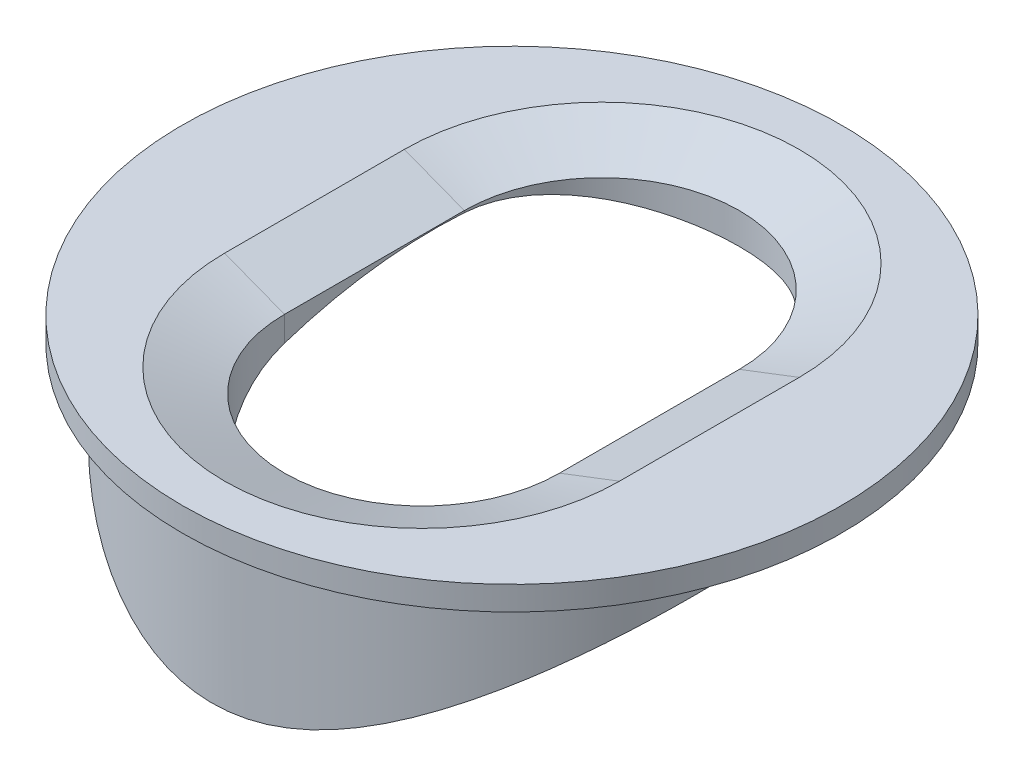
ISO-10303-21;
HEADER;
FILE_DESCRIPTION(('STEP AP214'),'2;1');
FILE_NAME('part.step','',(''),(''),'','','');
FILE_SCHEMA(('AUTOMOTIVE_DESIGN { 1 0 10303 214 1 1 1 1 }'));
ENDSEC;
DATA;
#1=APPLICATION_CONTEXT('core data for automotive mechanical design processes');
#2=APPLICATION_PROTOCOL_DEFINITION('international standard','automotive_design',2000,#1);
#3=PRODUCT_CONTEXT('',#1,'mechanical');
#4=PRODUCT('Part','Part','',(#3));
#5=PRODUCT_RELATED_PRODUCT_CATEGORY('part','',(#4));
#6=PRODUCT_DEFINITION_FORMATION('','',#4);
#7=PRODUCT_DEFINITION_CONTEXT('part definition',#1,'design');
#8=PRODUCT_DEFINITION('design','',#6,#7);
#9=PRODUCT_DEFINITION_SHAPE('','',#8);
#10=(LENGTH_UNIT() NAMED_UNIT(*) SI_UNIT(.MILLI.,.METRE.));
#11=(NAMED_UNIT(*) PLANE_ANGLE_UNIT() SI_UNIT($,.RADIAN.));
#12=(NAMED_UNIT(*) SI_UNIT($,.STERADIAN.) SOLID_ANGLE_UNIT());
#13=UNCERTAINTY_MEASURE_WITH_UNIT(LENGTH_MEASURE(1.E-05),#10,'distance_accuracy_value','');
#14=(GEOMETRIC_REPRESENTATION_CONTEXT(3) GLOBAL_UNCERTAINTY_ASSIGNED_CONTEXT((#13)) GLOBAL_UNIT_ASSIGNED_CONTEXT((#10,
#11,#12)) REPRESENTATION_CONTEXT('',''));
#15=CARTESIAN_POINT('',(0.,0.,0.));
#16=DIRECTION('',(0.,0.,1.));
#17=DIRECTION('',(1.,0.,0.));
#18=AXIS2_PLACEMENT_3D('',#15,#16,#17);
#19=CARTESIAN_POINT('',(0.,5.,0.));
#20=DIRECTION('',(0.,-1.,0.));
#21=DIRECTION('',(0.,0.,-1.));
#22=AXIS2_PLACEMENT_3D('',#19,#20,#21);
#23=CYLINDRICAL_SURFACE('',#22,5.);
#24=CARTESIAN_POINT('',(0.,5.,0.));
#25=DIRECTION('',(0.,1.,0.));
#26=DIRECTION('',(0.,0.,1.));
#27=AXIS2_PLACEMENT_3D('',#24,#25,#26);
#28=CIRCLE('',#27,5.);
#29=CARTESIAN_POINT('',(4.89897948556636,5.,-0.999999999999999));
#30=VERTEX_POINT('',#29);
#31=CARTESIAN_POINT('',(-4.89897948556636,5.,-0.999999999999999));
#32=VERTEX_POINT('',#31);
#33=EDGE_CURVE('E103',#30,#32,#28,.T.);
#34=ORIENTED_EDGE('',*,*,#33,.F.);
#35=CARTESIAN_POINT('',(4.89897948556636,5.,-0.999999999999999));
#36=CARTESIAN_POINT('',(4.87272929620755,4.99999907683315,-1.12859383142094));
#37=CARTESIAN_POINT('',(4.84140533566969,4.99689175891356,-1.25617590728166));
#38=CARTESIAN_POINT('',(4.76889115793467,4.98483566249985,-1.50827726145347));
#39=CARTESIAN_POINT('',(4.72769527616492,4.97588352510558,-1.63279473587616));
#40=CARTESIAN_POINT('',(4.63575295045975,4.95262649453555,-1.878022454464));
#41=CARTESIAN_POINT('',(4.5849877253551,4.93831101955594,-1.99872465723745));
#42=CARTESIAN_POINT('',(4.47444270306235,4.90496082829384,-2.23527113123434));
#43=CARTESIAN_POINT('',(4.4146589120664,4.88592401878429,-2.35111322099658));
#44=CARTESIAN_POINT('',(4.22333263261334,4.82302997926215,-2.68887099045072));
#45=CARTESIAN_POINT('',(4.07917669801213,4.77321258223791,-2.90270344781501));
#46=CARTESIAN_POINT('',(3.76147906085211,4.66385328341102,-3.30407649430298));
#47=CARTESIAN_POINT('',(3.58793994401195,4.60431223730537,-3.49161939425428));
#48=CARTESIAN_POINT('',(3.19943147471887,4.47691987682313,-3.85222440276629));
#49=CARTESIAN_POINT('',(2.98221193162379,4.40878988536776,-4.02276710259718));
#50=CARTESIAN_POINT('',(2.52132755785255,4.27746917506397,-4.32654741965495));
#51=CARTESIAN_POINT('',(2.27764855568575,4.2142811345642,-4.45976490766092));
#52=CARTESIAN_POINT('',(1.89115851967898,4.12891431761144,-4.6308200764804));
#53=CARTESIAN_POINT('',(1.75599708466028,4.101598194791,-4.68376564470803));
#54=CARTESIAN_POINT('',(1.48077664610946,4.05196688926293,-4.77790946303891));
#55=CARTESIAN_POINT('',(1.34072010767097,4.02964923019189,-4.81911353294049));
#56=CARTESIAN_POINT('',(1.0568938514765,3.99111488999557,-4.88920492687552));
#57=CARTESIAN_POINT('',(0.913128260155104,3.97489171696235,-4.91810536126498));
#58=CARTESIAN_POINT('',(0.623015020037614,3.94936666298495,-4.96320345016111));
#59=CARTESIAN_POINT('',(0.476667802864648,3.94006363607806,-4.97940320789906));
#60=CARTESIAN_POINT('',(0.20004527868091,3.9295439630269,-4.99768827692173));
#61=CARTESIAN_POINT('',(0.0698934839262378,3.92750837135248,-5.00120354859229));
#62=CARTESIAN_POINT('',(-0.190291668130075,3.92931653499068,-4.99807163905904));
#63=CARTESIAN_POINT('',(-0.320324973506614,3.9331621921922,-4.99142117044008));
#64=CARTESIAN_POINT('',(-0.57915192049688,3.94656829238445,-4.96804374092082));
#65=CARTESIAN_POINT('',(-0.707945873075363,3.95612726174272,-4.95131937836755));
#66=CARTESIAN_POINT('',(-0.963375791252676,3.98054006235103,-4.9080256259762));
#67=CARTESIAN_POINT('',(-1.09001087636401,3.99539600226545,-4.88145231521608));
#68=CARTESIAN_POINT('',(-1.45224555766398,4.04524074391438,-4.79068039347314));
#69=CARTESIAN_POINT('',(-1.68402036144016,4.08635340287599,-4.71408544729069));
#70=CARTESIAN_POINT('',(-2.13187937413148,4.18019343449578,-4.52923156117458));
#71=CARTESIAN_POINT('',(-2.34795778189367,4.23292507260645,-4.42096098798006));
#72=CARTESIAN_POINT('',(-2.78511336537645,4.3504994793282,-4.16113362857658));
#73=CARTESIAN_POINT('',(-3.0038942596883,4.41603764206289,-4.00602527069445));
#74=CARTESIAN_POINT('',(-3.41430371274256,4.54616423053725,-3.66252966070918));
#75=CARTESIAN_POINT('',(-3.60591368896455,4.61075197947845,-3.47411982927578));
#76=CARTESIAN_POINT('',(-3.87651442978386,4.70337587960228,-3.16127885558738));
#77=CARTESIAN_POINT('',(-3.96674616705032,4.73455210355397,-3.04731799477503));
#78=CARTESIAN_POINT('',(-4.13732816455751,4.79318723134245,-2.81134902484352));
#79=CARTESIAN_POINT('',(-4.217682508881,4.82064767204981,-2.68934427397131));
#80=CARTESIAN_POINT('',(-4.36774308346601,4.87072654833304,-2.43807880215393));
#81=CARTESIAN_POINT('',(-4.43745389754861,4.89334706999829,-2.308821237744));
#82=CARTESIAN_POINT('',(-4.56551696802833,4.93272390669725,-2.04393830034362));
#83=CARTESIAN_POINT('',(-4.62387076214317,4.94948101587074,-1.90831379251535));
#84=CARTESIAN_POINT('',(-4.72413507361429,4.97509752183173,-1.64343786021046));
#85=CARTESIAN_POINT('',(-4.7670139618913,4.98450123181001,-1.51460530297943));
#86=CARTESIAN_POINT('',(-4.84220281006683,4.99704633766398,-1.25359863296091));
#87=CARTESIAN_POINT('',(-4.87451407873295,5.00018850925786,-1.12142493614932));
#88=CARTESIAN_POINT('',(-4.92823328700264,4.99979408306917,-0.854971807841031));
#89=CARTESIAN_POINT('',(-4.94964795128432,4.99626161080484,-0.720693727909927));
#90=CARTESIAN_POINT('',(-4.98144808349964,4.98229394431395,-0.451198565996212));
#91=CARTESIAN_POINT('',(-4.99183442089782,4.97185929435487,-0.315981558884021));
#92=CARTESIAN_POINT('',(-5.0010904264408,4.94555480123782,-0.0603992168078022));
#93=CARTESIAN_POINT('',(-5.00107788574364,4.93038964177752,0.060000413896035));
#94=CARTESIAN_POINT('',(-4.99245014501065,4.89464520622961,0.299718226311509));
#95=CARTESIAN_POINT('',(-4.98383229879877,4.87406426619512,0.419036063977598));
#96=CARTESIAN_POINT('',(-4.95824511960102,4.82771545922289,0.655718147272553));
#97=CARTESIAN_POINT('',(-4.9412780226097,4.80194898210379,0.773082907255828));
#98=CARTESIAN_POINT('',(-4.89933764509456,4.74554575974882,1.00519808760155));
#99=CARTESIAN_POINT('',(-4.87436127284159,4.71490713607997,1.11994748003223));
#100=CARTESIAN_POINT('',(-4.78674070881373,4.61481877820288,1.46420094793422));
#101=CARTESIAN_POINT('',(-4.71196697168422,4.53819744847531,1.68867241552934));
#102=CARTESIAN_POINT('',(-4.53433196731111,4.37016832198831,2.11999611722494));
#103=CARTESIAN_POINT('',(-4.43146549675685,4.27875778726538,2.32684507797987));
#104=CARTESIAN_POINT('',(-4.18418049286137,4.07125616738605,2.74974435050862));
#105=CARTESIAN_POINT('',(-4.03588346392477,3.95351104917513,2.96270832513281));
#106=CARTESIAN_POINT('',(-3.71052139990236,3.71070181923114,3.36131034654458));
#107=CARTESIAN_POINT('',(-3.53340520168037,3.58562494870067,3.54689865474679));
#108=CARTESIAN_POINT('',(-3.23122719838711,3.38721623568104,3.81861744684771));
#109=CARTESIAN_POINT('',(-3.11467899432754,3.3137394612721,3.91428140033119));
#110=CARTESIAN_POINT('',(-2.87260181964106,3.16862558275378,4.09524220983937));
#111=CARTESIAN_POINT('',(-2.74707002350111,3.09698906715402,4.18053578121146));
#112=CARTESIAN_POINT('',(-2.48734522517004,2.95774605718571,4.34008022282809));
#113=CARTESIAN_POINT('',(-2.35316561708932,2.89013362839528,4.41434760822186));
#114=CARTESIAN_POINT('',(-2.07617056086752,2.76134021019144,4.55119649128857));
#115=CARTESIAN_POINT('',(-1.933360898415,2.7001549856299,4.61378570556525));
#116=CARTESIAN_POINT('',(-1.6010816354712,2.57249034292482,4.74085626954144));
#117=CARTESIAN_POINT('',(-1.40907732949048,2.50871539912872,4.80166232891827));
#118=CARTESIAN_POINT('',(-1.11268649942019,2.42933081790329,4.87568535661002));
#119=CARTESIAN_POINT('',(-1.01253983147774,2.40558939905328,4.8974893121693));
#120=CARTESIAN_POINT('',(-0.809877807458809,2.36432499178028,4.93504820186925));
#121=CARTESIAN_POINT('',(-0.707363682740355,2.34679884495475,4.95080620870219));
#122=CARTESIAN_POINT('',(-0.499615296156107,2.31852936126625,4.97608669590077));
#123=CARTESIAN_POINT('',(-0.394364360433467,2.30785283274974,4.98554779117453));
#124=CARTESIAN_POINT('',(-0.182977481596313,2.29403586596155,4.99777211743152));
#125=CARTESIAN_POINT('',(-0.0768415647228182,2.29089520503187,5.00053554630693));
#126=CARTESIAN_POINT('',(0.135354202632138,2.29230414496619,4.99929326574771));
#127=CARTESIAN_POINT('',(0.241414043905455,2.29685455732994,4.99528684201307));
#128=CARTESIAN_POINT('',(0.452455828343521,2.31341700719161,4.98061134311834));
#129=CARTESIAN_POINT('',(0.557437782428576,2.325428969019,4.96994233552615));
#130=CARTESIAN_POINT('',(0.846248495865678,2.36843747126258,4.93138214454397));
#131=CARTESIAN_POINT('',(1.02809309160246,2.40693252884785,4.89655155842286));
#132=CARTESIAN_POINT('',(1.3825039820243,2.50134718517606,4.80855132592646));
#133=CARTESIAN_POINT('',(1.55506124069342,2.5572834061762,4.75536417968703));
#134=CARTESIAN_POINT('',(1.85471864532485,2.66868733006612,4.64542112742893));
#135=CARTESIAN_POINT('',(1.98382540026079,2.72184726341183,4.59169192593062));
#136=CARTESIAN_POINT('',(2.23511568760753,2.8338292368807,4.47475920446477));
#137=CARTESIAN_POINT('',(2.35729774486393,2.89265247629754,4.41155367615056));
#138=CARTESIAN_POINT('',(2.5948872863759,3.01421101371827,4.27613091157822));
#139=CARTESIAN_POINT('',(2.71028031134144,3.0769541134664,4.20389539724427));
#140=CARTESIAN_POINT('',(2.93393777215248,3.20464742302458,4.05096996975102));
#141=CARTESIAN_POINT('',(3.04220321127358,3.26959732024717,3.97028125062197));
#142=CARTESIAN_POINT('',(3.36260813918172,3.46969630274781,3.71078870959475));
#143=CARTESIAN_POINT('',(3.56326808613415,3.60631159549788,3.51860930691021));
#144=CARTESIAN_POINT('',(3.9316161856324,3.87302785514091,3.10156515119989));
#145=CARTESIAN_POINT('',(4.09934351207963,4.00313642282828,2.87673979194841));
#146=CARTESIAN_POINT('',(4.38472775890577,4.23783956440366,2.41676298525169));
#147=CARTESIAN_POINT('',(4.50546217197455,4.34366779050108,2.18419017374345));
#148=CARTESIAN_POINT('',(4.65949148176806,4.48823930452671,1.81843394815252));
#149=CARTESIAN_POINT('',(4.70634294954088,4.53409177515667,1.69361727674994));
#150=CARTESIAN_POINT('',(4.79033935951314,4.62033581294261,1.43895756549179));
#151=CARTESIAN_POINT('',(4.82748883084091,4.66072992392843,1.30911690357715));
#152=CARTESIAN_POINT('',(4.89171065979693,4.73571018846087,1.04400076703484));
#153=CARTESIAN_POINT('',(4.91869019631812,4.77024133474933,0.908687151393709));
#154=CARTESIAN_POINT('',(4.96147189426292,4.83243781609489,0.634814412021108));
#155=CARTESIAN_POINT('',(4.97727996354549,4.86010677508178,0.496257043813154));
#156=CARTESIAN_POINT('',(4.99722578949508,4.90809973982114,0.217350036262635));
#157=CARTESIAN_POINT('',(5.00138862435631,4.92843944675012,0.0770049031573651));
#158=CARTESIAN_POINT('',(4.99780052532559,4.96159383700929,-0.204348429467268));
#159=CARTESIAN_POINT('',(4.99005775323359,4.97441366721322,-0.34535610873001));
#160=CARTESIAN_POINT('',(4.9679127944041,4.98901798559943,-0.572142750892873));
#161=CARTESIAN_POINT('',(4.9572515224162,4.99315349665988,-0.658159191964613));
#162=CARTESIAN_POINT('',(4.9314581799157,4.99864461832,-0.829597650901066));
#163=CARTESIAN_POINT('',(4.91632672271332,5.00000061006776,-0.915019748665244));
#164=CARTESIAN_POINT('',(4.89897948556636,5.,-0.999999999999999));
#165=B_SPLINE_CURVE_WITH_KNOTS('',3,(#35,#36,#37,#38,#39,#40,#41,#42,#43,#44,#45,#46,#47,#48,
#49,#50,#51,#52,#53,#54,#55,#56,#57,#58,#59,#60,#61,#62,#63,#64,#65,#66,#67,#68,#69,#70,#71,#72,
#73,#74,#75,#76,#77,#78,#79,#80,#81,#82,#83,#84,#85,#86,#87,#88,#89,#90,#91,#92,#93,#94,#95,#96,
#97,#98,#99,#100,#101,#102,#103,#104,#105,#106,#107,#108,#109,#110,#111,#112,#113,#114,#115,
#116,#117,#118,#119,#120,#121,#122,#123,#124,#125,#126,#127,#128,#129,#130,#131,#132,#133,#134,
#135,#136,#137,#138,#139,#140,#141,#142,#143,#144,#145,#146,#147,#148,#149,#150,#151,#152,#153,
#154,#155,#156,#157,#158,#159,#160,#161,#162,#163,#164),.UNSPECIFIED.,.T.,.F.,(4,2,2,2,2,2,2,2,
2,2,2,2,2,2,2,2,2,2,2,2,2,2,2,2,2,2,2,2,2,2,2,2,2,2,2,2,2,2,2,2,2,2,2,2,2,2,2,2,2,2,2,2,2,2,2,2,
2,2,2,2,2,2,2,2,4),(0.,0.393643549410294,0.787513517202563,1.18216471369793,1.57699119452634,
2.36127967575758,3.14549917547614,3.9952466525736,4.84545151422359,5.28805323190806,
5.73043518623574,6.17234456558528,6.61418074930205,7.00430803384786,7.39456150514042,
7.78471436191277,8.17502270787337,8.91435889116033,9.65396694628522,10.4788530236926,
11.3043005575683,11.7497935836925,12.1951017842723,12.6402176608816,13.0852732277019,
13.4930190844203,13.9007144239131,14.3081578541771,14.7155691595387,15.0791935652981,
15.4429298218916,15.8065687200461,16.1703481588933,16.9132332296837,17.6562559904033,
18.50805770912,19.3613884837778,19.8640978455098,20.366966019876,20.8690732244226,
21.3708474666413,22.0020344464237,22.3173399314342,22.6324849578994,22.9506588364227,
23.268823313927,23.5870213636657,23.9052161864842,24.4701471751876,25.035618224172,
25.4838390096328,25.9321549225132,26.3813934531135,26.8305686133096,27.7556512399692,
28.6796267086888,29.5236176883173,29.9461318620171,30.3684484418078,30.7945311969228,
31.2203884557534,31.6453279157127,32.0699761914511,32.3301482036343,32.5902845367348),.UNSPECIFIED.);
#166=EDGE_CURVE('E115',#30,#32,#165,.T.);
#167=ORIENTED_EDGE('',*,*,#166,.T.);
#168=EDGE_LOOP('',(#34,#167));
#169=FACE_BOUND('',#168,.T.);
#170=ADVANCED_FACE('F32',(#169),#23,.T.);
#171=EDGE_CURVE('E122',#32,#30,#28,.T.);
#172=ORIENTED_EDGE('',*,*,#171,.F.);
#173=EDGE_CURVE('E173',#32,#30,#165,.T.);
#174=ORIENTED_EDGE('',*,*,#173,.T.);
#175=EDGE_LOOP('',(#172,#174));
#176=FACE_BOUND('',#175,.T.);
#177=ADVANCED_FACE('F185',(#176),#23,.T.);
#178=CARTESIAN_POINT('',(0.,5.,0.));
#179=DIRECTION('',(0.,1.,0.));
#180=DIRECTION('',(0.,0.,1.));
#181=AXIS2_PLACEMENT_3D('',#178,#179,#180);
#182=PLANE('',#181);
#183=ORIENTED_EDGE('',*,*,#33,.T.);
#184=ORIENTED_EDGE('',*,*,#171,.T.);
#185=EDGE_LOOP('',(#183,#184));
#186=FACE_BOUND('',#185,.T.);
#187=CARTESIAN_POINT('',(0.,5.,0.));
#188=DIRECTION('',(0.,1.,0.));
#189=DIRECTION('',(0.,0.,1.));
#190=AXIS2_PLACEMENT_3D('',#187,#188,#189);
#191=CIRCLE('',#190,5.5);
#192=CARTESIAN_POINT('',(0.,5.,5.5));
#193=VERTEX_POINT('',#192);
#194=EDGE_CURVE('E123',#193,#193,#191,.T.);
#195=ORIENTED_EDGE('',*,*,#194,.F.);
#196=EDGE_LOOP('',(#195));
#197=FACE_BOUND('',#196,.T.);
#198=ADVANCED_FACE('F209',(#186,#197),#182,.F.);
#199=CARTESIAN_POINT('',(0.,5.4,0.));
#200=DIRECTION('',(0.,-1.,0.));
#201=DIRECTION('',(0.,0.,-1.));
#202=AXIS2_PLACEMENT_3D('',#199,#200,#201);
#203=CYLINDRICAL_SURFACE('',#202,5.5);
#204=CARTESIAN_POINT('',(0.,5.4,0.));
#205=DIRECTION('',(0.,1.,0.));
#206=DIRECTION('',(0.,0.,1.));
#207=AXIS2_PLACEMENT_3D('',#204,#205,#206);
#208=CIRCLE('',#207,5.5);
#209=CARTESIAN_POINT('',(0.,5.4,5.5));
#210=VERTEX_POINT('',#209);
#211=EDGE_CURVE('E119',#210,#210,#208,.T.);
#212=ORIENTED_EDGE('',*,*,#211,.F.);
#213=EDGE_LOOP('',(#212));
#214=FACE_BOUND('',#213,.T.);
#215=ORIENTED_EDGE('',*,*,#194,.T.);
#216=EDGE_LOOP('',(#215));
#217=FACE_BOUND('',#216,.T.);
#218=ADVANCED_FACE('F208',(#214,#217),#203,.T.);
#219=CARTESIAN_POINT('',(0.,5.4,0.));
#220=DIRECTION('',(0.,1.,0.));
#221=DIRECTION('',(0.,0.,1.));
#222=AXIS2_PLACEMENT_3D('',#219,#220,#221);
#223=PLANE('',#222);
#224=DIRECTION('',(0.,0.,-1.));
#225=VECTOR('',#224,1.);
#226=CARTESIAN_POINT('',(-3.29525037907765,5.4,-1.5));
#227=LINE('',#226,#225);
#228=CARTESIAN_POINT('',(-3.29525037907764,5.4,1.5));
#229=VERTEX_POINT('',#228);
#230=CARTESIAN_POINT('',(-3.29525037907765,5.4,-1.5));
#231=VERTEX_POINT('',#230);
#232=EDGE_CURVE('E134',#229,#231,#227,.T.);
#233=ORIENTED_EDGE('',*,*,#232,.T.);
#234=CARTESIAN_POINT('',(0.,5.4,-1.5));
#235=DIRECTION('',(0.,1.,0.));
#236=DIRECTION('',(0.,0.,1.));
#237=AXIS2_PLACEMENT_3D('',#234,#235,#236);
#238=CIRCLE('',#237,3.29525037907765);
#239=CARTESIAN_POINT('',(3.29525037907764,5.4,-1.5));
#240=VERTEX_POINT('',#239);
#241=EDGE_CURVE('E136',#231,#240,#238,.F.);
#242=ORIENTED_EDGE('',*,*,#241,.T.);
#243=DIRECTION('',(0.,0.,1.));
#244=VECTOR('',#243,1.);
#245=CARTESIAN_POINT('',(3.29525037907765,5.4,1.5));
#246=LINE('',#245,#244);
#247=CARTESIAN_POINT('',(3.29525037907765,5.4,1.5));
#248=VERTEX_POINT('',#247);
#249=EDGE_CURVE('E132',#240,#248,#246,.T.);
#250=ORIENTED_EDGE('',*,*,#249,.T.);
#251=CARTESIAN_POINT('',(0.,5.4,1.5));
#252=DIRECTION('',(0.,1.,0.));
#253=DIRECTION('',(0.,0.,1.));
#254=AXIS2_PLACEMENT_3D('',#251,#252,#253);
#255=CIRCLE('',#254,3.29525037907765);
#256=EDGE_CURVE('E130',#248,#229,#255,.F.);
#257=ORIENTED_EDGE('',*,*,#256,.T.);
#258=EDGE_LOOP('',(#233,#242,#250,#257));
#259=FACE_BOUND('',#258,.T.);
#260=ORIENTED_EDGE('',*,*,#211,.T.);
#261=EDGE_LOOP('',(#260));
#262=FACE_BOUND('',#261,.T.);
#263=ADVANCED_FACE('F159',(#259,#262),#223,.T.);
#264=CARTESIAN_POINT('',(0.,0.,-1.5));
#265=DIRECTION('',(0.,1.,0.));
#266=DIRECTION('',(0.,0.,1.));
#267=AXIS2_PLACEMENT_3D('',#264,#265,#266);
#268=CYLINDRICAL_SURFACE('',#267,2.29525037907763);
#269=DIRECTION('',(0.,1.,0.));
#270=VECTOR('',#269,1.);
#271=CARTESIAN_POINT('',(2.29525037907763,0.,-1.5));
#272=LINE('',#271,#270);
#273=CARTESIAN_POINT('',(2.29525037907763,4.98435971133566,-1.5));
#274=VERTEX_POINT('',#273);
#275=CARTESIAN_POINT('',(2.29525037907763,5.01613596496458,-1.5));
#276=VERTEX_POINT('',#275);
#277=EDGE_CURVE('E113',#274,#276,#272,.T.);
#278=ORIENTED_EDGE('',*,*,#277,.T.);
#279=CARTESIAN_POINT('',(0.,5.01613596496458,-1.5));
#280=DIRECTION('',(0.,1.,0.));
#281=DIRECTION('',(0.,0.,1.));
#282=AXIS2_PLACEMENT_3D('',#279,#280,#281);
#283=CIRCLE('',#282,2.29525037907763);
#284=CARTESIAN_POINT('',(-2.29525037907763,5.01613596496458,-1.5));
#285=VERTEX_POINT('',#284);
#286=EDGE_CURVE('E102',#276,#285,#283,.T.);
#287=ORIENTED_EDGE('',*,*,#286,.T.);
#288=DIRECTION('',(0.,1.,0.));
#289=VECTOR('',#288,1.);
#290=CARTESIAN_POINT('',(-2.29525037907763,0.,-1.5));
#291=LINE('',#290,#289);
#292=CARTESIAN_POINT('',(-2.29525037907763,4.98435971133566,-1.5));
#293=VERTEX_POINT('',#292);
#294=EDGE_CURVE('E111',#293,#285,#291,.T.);
#295=ORIENTED_EDGE('',*,*,#294,.F.);
#296=CARTESIAN_POINT('',(-2.29525037907763,4.98435971133566,-1.5));
#297=CARTESIAN_POINT('',(-2.29525786648849,4.98036196224118,-1.56395597831327));
#298=CARTESIAN_POINT('',(-2.29257741225323,4.97558177044315,-1.62785620229301));
#299=CARTESIAN_POINT('',(-2.28192424926876,4.96454111826049,-1.75506907017564));
#300=CARTESIAN_POINT('',(-2.27395290903306,4.95828104092498,-1.81838186172803));
#301=CARTESIAN_POINT('',(-2.25282782599403,4.94438039002383,-1.9438211452449));
#302=CARTESIAN_POINT('',(-2.23968702258598,4.93674328886553,-2.00595019617908));
#303=CARTESIAN_POINT('',(-2.20836639821624,4.92021433349807,-2.12873829708076));
#304=CARTESIAN_POINT('',(-2.19018638141171,4.91132243052916,-2.18939728981659));
#305=CARTESIAN_POINT('',(-2.12833542488955,4.8830055381442,-2.36848969383848));
#306=CARTESIAN_POINT('',(-2.07732269079496,4.86191873348411,-2.48421948358203));
#307=CARTESIAN_POINT('',(-1.95734658020885,4.81694453933621,-2.70533323880891));
#308=CARTESIAN_POINT('',(-1.88837419031812,4.7930557469346,-2.81071197273787));
#309=CARTESIAN_POINT('',(-1.73191542647669,4.7436394817983,-3.01173631574099));
#310=CARTESIAN_POINT('',(-1.64392705542641,4.71808423331041,-3.10698535968935));
#311=CARTESIAN_POINT('',(-1.45297075862062,4.66830852618784,-3.28151300124456));
#312=CARTESIAN_POINT('',(-1.35000027873756,4.6440882961178,-3.36078887026184));
#313=CARTESIAN_POINT('',(-1.13009382663007,4.59902196292367,-3.50209001412756));
#314=CARTESIAN_POINT('',(-1.01298859871431,4.57822564036527,-3.56386884514916));
#315=CARTESIAN_POINT('',(-0.769121794105818,4.54269705302506,-3.6665897320385));
#316=CARTESIAN_POINT('',(-0.642364454298095,4.52796214550682,-3.70754087048569));
#317=CARTESIAN_POINT('',(-0.389007037912966,4.50682112768358,-3.76560203603754));
#318=CARTESIAN_POINT('',(-0.262668384159476,4.50006280617503,-3.78372286622457));
#319=CARTESIAN_POINT('',(-0.00857511576214296,4.49446671448106,-3.79875726799421));
#320=CARTESIAN_POINT('',(0.119179088989951,4.49562670834284,-3.79567682633349));
#321=CARTESIAN_POINT('',(0.366261341052352,4.50548640566408,-3.76908798843361));
#322=CARTESIAN_POINT('',(0.485706939477517,4.51383746371361,-3.74652407422964));
#323=CARTESIAN_POINT('',(0.71899648295488,4.53672419416189,-3.68307939286544));
#324=CARTESIAN_POINT('',(0.832839810137906,4.55126054703305,-3.64219661033699));
#325=CARTESIAN_POINT('',(1.05429623996705,4.58542502129039,-3.54246832462455));
#326=CARTESIAN_POINT('',(1.16174064590672,4.60514855797724,-3.48328211195177));
#327=CARTESIAN_POINT('',(1.36545320003953,4.64770530855181,-3.34894811085422));
#328=CARTESIAN_POINT('',(1.46171831084446,4.67053936391534,-3.27379600015185));
#329=CARTESIAN_POINT('',(1.64611348084352,4.71870804464727,-3.10468389872177));
#330=CARTESIAN_POINT('',(1.73346811795445,4.74411102017934,-3.0098965863912));
#331=CARTESIAN_POINT('',(1.89124668142056,4.79398214201448,-2.80686393491656));
#332=CARTESIAN_POINT('',(1.96166393702464,4.81844991681018,-2.69861331866015));
#333=CARTESIAN_POINT('',(2.08487199563202,4.86487446879478,-2.46893179097617));
#334=CARTESIAN_POINT('',(2.13725796580145,4.88676710146855,-2.34727031636631));
#335=CARTESIAN_POINT('',(2.22041660829086,4.92556523921725,-2.09611794966805));
#336=CARTESIAN_POINT('',(2.25122347414162,4.94247860949565,-1.96663979891793));
#337=CARTESIAN_POINT('',(2.27881652703108,4.96209428888545,-1.77986885109375));
#338=CARTESIAN_POINT('',(2.28497482541532,4.96736091192204,-1.72409778690918));
#339=CARTESIAN_POINT('',(2.29318793367274,4.97673523097752,-1.61223982069334));
#340=CARTESIAN_POINT('',(2.29524869389613,4.98084460007354,-1.55615349543381));
#341=CARTESIAN_POINT('',(2.29525037907773,4.98435971133568,-1.50000000000002));
#342=B_SPLINE_CURVE_WITH_KNOTS('',3,(#296,#297,#298,#299,#300,#301,#302,#303,#304,#305,#306,
#307,#308,#309,#310,#311,#312,#313,#314,#315,#316,#317,#318,#319,#320,#321,#322,#323,#324,#325,
#326,#327,#328,#329,#330,#331,#332,#333,#334,#335,#336,#337,#338,#339,#340,#341),.UNSPECIFIED.,
.F.,.F.,(4,2,2,2,2,2,2,2,2,2,2,2,2,2,2,2,2,2,2,2,2,2,4),(0.,0.192170640132745,0.384291593750475,
0.575934688989315,0.767585233246216,1.15033906789502,1.53328536641059,1.92795121958311,
2.32268443380614,2.722728482341,3.122597929012,3.50405814960475,3.88541065893287,
4.24925266159517,4.61313470252351,4.98424555271064,5.35545699810311,5.74780726419642,
6.14031180449316,6.54112798966767,6.94130760925877,7.11024390277685,7.27893469122011),.UNSPECIFIED.);
#343=EDGE_CURVE('E100',#293,#274,#342,.T.);
#344=ORIENTED_EDGE('',*,*,#343,.T.);
#345=EDGE_LOOP('',(#278,#287,#295,#344));
#346=FACE_BOUND('',#345,.T.);
#347=ADVANCED_FACE('F169',(#346),#268,.F.);
#348=CARTESIAN_POINT('',(2.29525037907763,0.,-1.5));
#349=DIRECTION('',(1.,0.,0.));
#350=DIRECTION('',(0.,0.,-1.));
#351=AXIS2_PLACEMENT_3D('',#348,#349,#350);
#352=PLANE('',#351);
#353=DIRECTION('',(0.,1.,0.));
#354=VECTOR('',#353,1.);
#355=CARTESIAN_POINT('',(2.29525037907763,0.,1.5));
#356=LINE('',#355,#354);
#357=CARTESIAN_POINT('',(2.29525037907763,4.59934207678534,1.5));
#358=VERTEX_POINT('',#357);
#359=CARTESIAN_POINT('',(2.29525037907763,5.01613596496458,1.5));
#360=VERTEX_POINT('',#359);
#361=EDGE_CURVE('E107',#358,#360,#356,.T.);
#362=ORIENTED_EDGE('',*,*,#361,.T.);
#363=DIRECTION('',(0.,0.,-1.));
#364=VECTOR('',#363,1.);
#365=CARTESIAN_POINT('',(2.29525037907763,5.01613596496458,-1.5));
#366=LINE('',#365,#364);
#367=EDGE_CURVE('E41',#360,#276,#366,.T.);
#368=ORIENTED_EDGE('',*,*,#367,.T.);
#369=ORIENTED_EDGE('',*,*,#277,.F.);
#370=CARTESIAN_POINT('',(2.29525037907763,-3.,-0.999999999999999));
#371=DIRECTION('',(1.,0.,0.));
#372=DIRECTION('',(0.,0.,-1.));
#373=AXIS2_PLACEMENT_3D('',#370,#371,#372);
#374=CIRCLE('',#373,8.);
#375=EDGE_CURVE('E108',#274,#358,#374,.T.);
#376=ORIENTED_EDGE('',*,*,#375,.T.);
#377=EDGE_LOOP('',(#362,#368,#369,#376));
#378=FACE_BOUND('',#377,.T.);
#379=ADVANCED_FACE('F192',(#378),#352,.F.);
#380=CARTESIAN_POINT('',(0.,0.,1.5));
#381=DIRECTION('',(0.,1.,0.));
#382=DIRECTION('',(0.,0.,1.));
#383=AXIS2_PLACEMENT_3D('',#380,#381,#382);
#384=CYLINDRICAL_SURFACE('',#383,2.29525037907763);
#385=DIRECTION('',(0.,1.,0.));
#386=VECTOR('',#385,1.);
#387=CARTESIAN_POINT('',(-2.29525037907763,0.,1.5));
#388=LINE('',#387,#386);
#389=CARTESIAN_POINT('',(-2.29525037907763,4.59934207678534,1.5));
#390=VERTEX_POINT('',#389);
#391=CARTESIAN_POINT('',(-2.29525037907763,5.01613596496458,1.5));
#392=VERTEX_POINT('',#391);
#393=EDGE_CURVE('E106',#390,#392,#388,.T.);
#394=ORIENTED_EDGE('',*,*,#393,.T.);
#395=CARTESIAN_POINT('',(0.,5.01613596496458,1.5));
#396=DIRECTION('',(0.,1.,0.));
#397=DIRECTION('',(0.,0.,1.));
#398=AXIS2_PLACEMENT_3D('',#395,#396,#397);
#399=CIRCLE('',#398,2.29525037907763);
#400=EDGE_CURVE('E11',#392,#360,#399,.T.);
#401=ORIENTED_EDGE('',*,*,#400,.T.);
#402=ORIENTED_EDGE('',*,*,#361,.F.);
#403=CARTESIAN_POINT('',(2.29525037907763,4.59934207678534,1.5));
#404=CARTESIAN_POINT('',(2.29525541221415,4.57655272385033,1.56930370402776));
#405=CARTESIAN_POINT('',(2.29211199272579,4.55280384484008,1.63827136124354));
#406=CARTESIAN_POINT('',(2.2797466362336,4.50363421778391,1.77501534020595));
#407=CARTESIAN_POINT('',(2.27052808184711,4.47821440719444,1.84279230337939));
#408=CARTESIAN_POINT('',(2.24627142462675,4.42601257799988,1.97648754685143));
#409=CARTESIAN_POINT('',(2.23125309360299,4.39923545313025,2.04241133433454));
#410=CARTESIAN_POINT('',(2.19563672697217,4.34451859554103,2.17222594830222));
#411=CARTESIAN_POINT('',(2.17503794640755,4.31657870802116,2.23611650208852));
#412=CARTESIAN_POINT('',(2.10531048843298,4.23156599536703,2.4239213442707));
#413=CARTESIAN_POINT('',(2.04817795946109,4.17314602240642,2.54435941849227));
#414=CARTESIAN_POINT('',(1.91422570308765,4.05535539440281,2.77340988907955));
#415=CARTESIAN_POINT('',(1.83737412876289,3.99598334852904,2.88200274687091));
#416=CARTESIAN_POINT('',(1.66027002940663,3.8759282783636,3.09108407682337));
#417=CARTESIAN_POINT('',(1.55889754061186,3.81537731401482,3.1907063626127));
#418=CARTESIAN_POINT('',(1.3371828746267,3.7012048485752,3.37095274324172));
#419=CARTESIAN_POINT('',(1.2168696560328,3.64757299292897,3.45160537892709));
#420=CARTESIAN_POINT('',(0.991483945565157,3.56444776068996,3.57296802105754));
#421=CARTESIAN_POINT('',(0.890061291195982,3.53226828737383,3.61862326284186));
#422=CARTESIAN_POINT('',(0.679394714721116,3.47741115634648,3.69525030017072));
#423=CARTESIAN_POINT('',(0.570158972545155,3.45472372660595,3.72623720106887));
#424=CARTESIAN_POINT('',(0.345796580935656,3.42100408148265,3.77195387713816));
#425=CARTESIAN_POINT('',(0.230637477733743,3.41004534065675,3.7865811928102));
#426=CARTESIAN_POINT('',(-0.00106293953518435,3.40137306632701,3.7981753713197));
#427=CARTESIAN_POINT('',(-0.117603791840981,3.40365522584493,3.79514797685052));
#428=CARTESIAN_POINT('',(-0.33632258136782,3.42027027606885,3.77286869005864));
#429=CARTESIAN_POINT('',(-0.43877189598905,3.43337596383796,3.75526859059187));
#430=CARTESIAN_POINT('',(-0.638844470036449,3.46880691380152,3.70695509072921));
#431=CARTESIAN_POINT('',(-0.736466348000205,3.49113479820103,3.67623796060141));
#432=CARTESIAN_POINT('',(-0.930095134055636,3.54465047693051,3.60106265057935));
#433=CARTESIAN_POINT('',(-1.0257322647222,3.57625048420583,3.55595382583043));
#434=CARTESIAN_POINT('',(-1.20826743847703,3.64554062269815,3.45427591176523));
#435=CARTESIAN_POINT('',(-1.29516175597361,3.68323333252647,3.39770196748854));
#436=CARTESIAN_POINT('',(-1.47391572387687,3.76971306809155,3.26361403219994));
#437=CARTESIAN_POINT('',(-1.56394596780022,3.81928412807286,3.18416657267796));
#438=CARTESIAN_POINT('',(-1.72991285842521,3.92127929541605,3.01320598560278));
#439=CARTESIAN_POINT('',(-1.80583517366831,3.97370623476904,2.92168074852815));
#440=CARTESIAN_POINT('',(-1.9531294999957,4.08712916506012,2.71331674998471));
#441=CARTESIAN_POINT('',(-2.02201031500894,4.14820417515369,2.59474928684585));
#442=CARTESIAN_POINT('',(-2.13791464268625,4.26781672585228,2.34631269552257));
#443=CARTESIAN_POINT('',(-2.18496203780147,4.32635697522133,2.21645610149539));
#444=CARTESIAN_POINT('',(-2.24473626800805,4.42149027194717,1.98861451661496));
#445=CARTESIAN_POINT('',(-2.26352307051412,4.45940302674536,1.89274056264166));
#446=CARTESIAN_POINT('',(-2.28878673698779,4.53198597828996,1.69816775087277));
#447=CARTESIAN_POINT('',(-2.29526047870837,4.56665535048701,1.59946818301916));
#448=CARTESIAN_POINT('',(-2.29525037907763,4.59934207678534,1.5));
#449=B_SPLINE_CURVE_WITH_KNOTS('',3,(#403,#404,#405,#406,#407,#408,#409,#410,#411,#412,#413,
#414,#415,#416,#417,#418,#419,#420,#421,#422,#423,#424,#425,#426,#427,#428,#429,#430,#431,#432,
#433,#434,#435,#436,#437,#438,#439,#440,#441,#442,#443,#444,#445,#446,#447,#448),.UNSPECIFIED.,
.F.,.F.,(4,2,2,2,2,2,2,2,2,2,2,2,2,2,2,2,2,2,2,2,2,2,4),(0.,0.218759484543845,0.437397267243103,
0.655296187314449,0.873224209969489,1.30781704825946,1.74311623565769,2.2043059845827,
2.66479734574498,3.0107786472075,3.35640288029061,3.70417983139862,4.05184366453701,
4.36476034400691,4.67776605835829,5.00762003691299,5.33761398669324,5.72583690255204,
6.11445206185609,6.56277296891735,7.01060231822392,7.32422475890506,7.63792671484808),.UNSPECIFIED.);
#450=EDGE_CURVE('E97',#358,#390,#449,.T.);
#451=ORIENTED_EDGE('',*,*,#450,.T.);
#452=EDGE_LOOP('',(#394,#401,#402,#451));
#453=FACE_BOUND('',#452,.T.);
#454=ADVANCED_FACE('F105',(#453),#384,.F.);
#455=CARTESIAN_POINT('',(-2.29525037907763,0.,-1.5));
#456=DIRECTION('',(-1.,0.,0.));
#457=DIRECTION('',(0.,0.,1.));
#458=AXIS2_PLACEMENT_3D('',#455,#456,#457);
#459=PLANE('',#458);
#460=ORIENTED_EDGE('',*,*,#294,.T.);
#461=DIRECTION('',(0.,0.,1.));
#462=VECTOR('',#461,1.);
#463=CARTESIAN_POINT('',(-2.29525037907763,5.01613596496458,1.5));
#464=LINE('',#463,#462);
#465=EDGE_CURVE('E55',#285,#392,#464,.T.);
#466=ORIENTED_EDGE('',*,*,#465,.T.);
#467=ORIENTED_EDGE('',*,*,#393,.F.);
#468=CARTESIAN_POINT('',(-2.29525037907763,-3.,-0.999999999999999));
#469=DIRECTION('',(-1.,0.,0.));
#470=DIRECTION('',(0.,0.,1.));
#471=AXIS2_PLACEMENT_3D('',#468,#469,#470);
#472=CIRCLE('',#471,8.);
#473=EDGE_CURVE('E93',#390,#293,#472,.T.);
#474=ORIENTED_EDGE('',*,*,#473,.T.);
#475=EDGE_LOOP('',(#460,#466,#467,#474));
#476=FACE_BOUND('',#475,.T.);
#477=ADVANCED_FACE('F110',(#476),#459,.F.);
#478=CARTESIAN_POINT('',(-5.5,-3.,-0.999999999999999));
#479=DIRECTION('',(1.,0.,0.));
#480=DIRECTION('',(0.,0.,-1.));
#481=AXIS2_PLACEMENT_3D('',#478,#479,#480);
#482=CYLINDRICAL_SURFACE('',#481,8.);
#483=ORIENTED_EDGE('',*,*,#473,.F.);
#484=ORIENTED_EDGE('',*,*,#450,.F.);
#485=ORIENTED_EDGE('',*,*,#375,.F.);
#486=ORIENTED_EDGE('',*,*,#343,.F.);
#487=EDGE_LOOP('',(#483,#484,#485,#486));
#488=FACE_BOUND('',#487,.T.);
#489=ORIENTED_EDGE('',*,*,#173,.F.);
#490=ORIENTED_EDGE('',*,*,#166,.F.);
#491=EDGE_LOOP('',(#489,#490));
#492=FACE_BOUND('',#491,.T.);
#493=ADVANCED_FACE('F95',(#488,#492),#482,.F.);
#494=CARTESIAN_POINT('',(0.,5.01613596496458,1.5));
#495=DIRECTION('',(0.,1.,0.));
#496=DIRECTION('',(0.,0.,1.));
#497=AXIS2_PLACEMENT_3D('',#494,#495,#496);
#498=CONICAL_SURFACE('',#497,2.29525037907763,1.20427718387609);
#499=DIRECTION('',(0.933580426497203,-0.358367949545297,0.));
#500=VECTOR('',#499,1.);
#501=CARTESIAN_POINT('',(-3.29525037907764,5.4,1.5));
#502=LINE('',#501,#500);
#503=EDGE_CURVE('E144',#229,#392,#502,.T.);
#504=ORIENTED_EDGE('',*,*,#503,.F.);
#505=ORIENTED_EDGE('',*,*,#256,.F.);
#506=DIRECTION('',(0.933580426497203,0.358367949545297,0.));
#507=VECTOR('',#506,1.);
#508=CARTESIAN_POINT('',(2.29525037907763,5.01613596496458,1.5));
#509=LINE('',#508,#507);
#510=EDGE_CURVE('E36',#360,#248,#509,.T.);
#511=ORIENTED_EDGE('',*,*,#510,.F.);
#512=ORIENTED_EDGE('',*,*,#400,.F.);
#513=EDGE_LOOP('',(#504,#505,#511,#512));
#514=FACE_BOUND('',#513,.T.);
#515=ADVANCED_FACE('F34',(#514),#498,.F.);
#516=CARTESIAN_POINT('',(2.29525037907763,5.01613596496458,-1.5));
#517=DIRECTION('',(-0.358367949545297,0.933580426497203,0.));
#518=DIRECTION('',(-0.933580426497203,-0.358367949545297,0.));
#519=AXIS2_PLACEMENT_3D('',#516,#517,#518);
#520=PLANE('',#519);
#521=ORIENTED_EDGE('',*,*,#510,.T.);
#522=ORIENTED_EDGE('',*,*,#249,.F.);
#523=DIRECTION('',(0.933580426497203,0.358367949545297,0.));
#524=VECTOR('',#523,1.);
#525=CARTESIAN_POINT('',(2.29525037907763,5.01613596496458,-1.5));
#526=LINE('',#525,#524);
#527=EDGE_CURVE('E143',#276,#240,#526,.T.);
#528=ORIENTED_EDGE('',*,*,#527,.F.);
#529=ORIENTED_EDGE('',*,*,#367,.F.);
#530=EDGE_LOOP('',(#521,#522,#528,#529));
#531=FACE_BOUND('',#530,.T.);
#532=ADVANCED_FACE('F154',(#531),#520,.T.);
#533=CARTESIAN_POINT('',(-2.29525037907763,5.01613596496458,-1.5));
#534=DIRECTION('',(0.358367949545297,0.933580426497203,0.));
#535=DIRECTION('',(-0.933580426497203,0.358367949545297,0.));
#536=AXIS2_PLACEMENT_3D('',#533,#534,#535);
#537=PLANE('',#536);
#538=ORIENTED_EDGE('',*,*,#503,.T.);
#539=ORIENTED_EDGE('',*,*,#465,.F.);
#540=DIRECTION('',(0.933580426497203,-0.358367949545297,0.));
#541=VECTOR('',#540,1.);
#542=CARTESIAN_POINT('',(-3.29525037907765,5.4,-1.5));
#543=LINE('',#542,#541);
#544=EDGE_CURVE('E141',#231,#285,#543,.T.);
#545=ORIENTED_EDGE('',*,*,#544,.F.);
#546=ORIENTED_EDGE('',*,*,#232,.F.);
#547=EDGE_LOOP('',(#538,#539,#545,#546));
#548=FACE_BOUND('',#547,.T.);
#549=ADVANCED_FACE('F166',(#548),#537,.T.);
#550=CARTESIAN_POINT('',(0.,5.01613596496458,-1.5));
#551=DIRECTION('',(0.,1.,0.));
#552=DIRECTION('',(0.,0.,1.));
#553=AXIS2_PLACEMENT_3D('',#550,#551,#552);
#554=CONICAL_SURFACE('',#553,2.29525037907763,1.20427718387609);
#555=ORIENTED_EDGE('',*,*,#527,.T.);
#556=ORIENTED_EDGE('',*,*,#241,.F.);
#557=ORIENTED_EDGE('',*,*,#544,.T.);
#558=ORIENTED_EDGE('',*,*,#286,.F.);
#559=EDGE_LOOP('',(#555,#556,#557,#558));
#560=FACE_BOUND('',#559,.T.);
#561=ADVANCED_FACE('F164',(#560),#554,.F.);
#562=CLOSED_SHELL('',(#170,#177,#198,#218,#263,#347,#379,#454,#477,#493,#515,#532,#549,#561));
#563=MANIFOLD_SOLID_BREP('B2',#562);
#564=ADVANCED_BREP_SHAPE_REPRESENTATION('',(#18,#563),#14);
#565=SHAPE_DEFINITION_REPRESENTATION(#9,#564);
ENDSEC;
END-ISO-10303-21;
